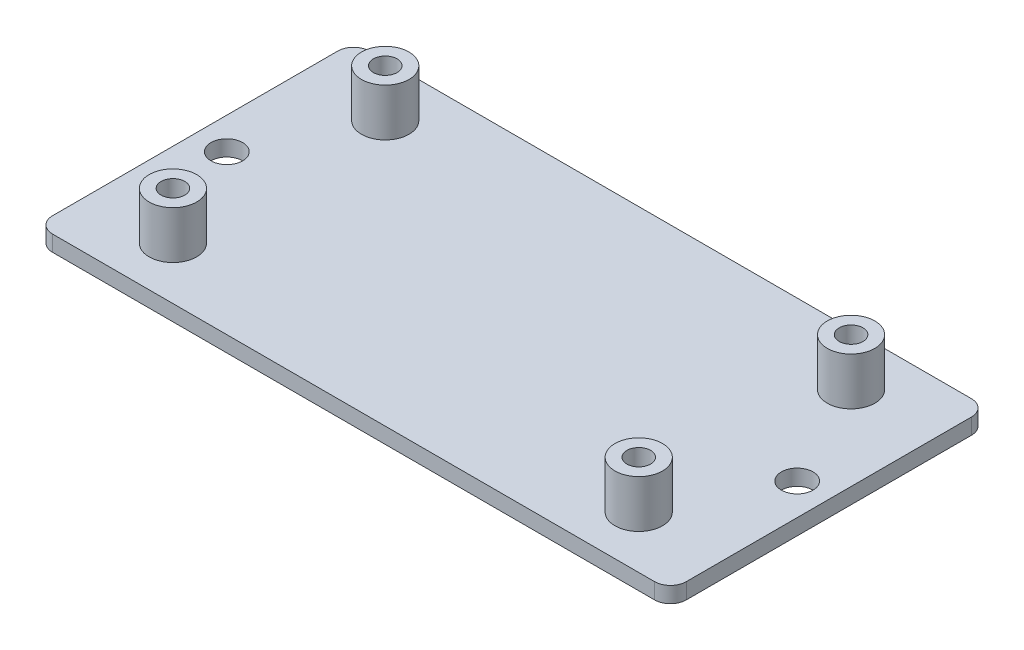
ISO-10303-21;
HEADER;
FILE_DESCRIPTION(('STEP AP214'),'2;1');
FILE_NAME('part.step','',(''),(''),'','','');
FILE_SCHEMA(('AUTOMOTIVE_DESIGN { 1 0 10303 214 1 1 1 1 }'));
ENDSEC;
DATA;
#1=APPLICATION_CONTEXT('core data for automotive mechanical design processes');
#2=APPLICATION_PROTOCOL_DEFINITION('international standard','automotive_design',2000,#1);
#3=PRODUCT_CONTEXT('',#1,'mechanical');
#4=PRODUCT('Part','Part','',(#3));
#5=PRODUCT_RELATED_PRODUCT_CATEGORY('part','',(#4));
#6=PRODUCT_DEFINITION_FORMATION('','',#4);
#7=PRODUCT_DEFINITION_CONTEXT('part definition',#1,'design');
#8=PRODUCT_DEFINITION('design','',#6,#7);
#9=PRODUCT_DEFINITION_SHAPE('','',#8);
#10=(LENGTH_UNIT() NAMED_UNIT(*) SI_UNIT(.MILLI.,.METRE.));
#11=(NAMED_UNIT(*) PLANE_ANGLE_UNIT() SI_UNIT($,.RADIAN.));
#12=(NAMED_UNIT(*) SI_UNIT($,.STERADIAN.) SOLID_ANGLE_UNIT());
#13=UNCERTAINTY_MEASURE_WITH_UNIT(LENGTH_MEASURE(1.E-05),#10,'distance_accuracy_value','');
#14=(GEOMETRIC_REPRESENTATION_CONTEXT(3) GLOBAL_UNCERTAINTY_ASSIGNED_CONTEXT((#13)) GLOBAL_UNIT_ASSIGNED_CONTEXT((#10,
#11,#12)) REPRESENTATION_CONTEXT('',''));
#15=CARTESIAN_POINT('',(0.,0.,0.));
#16=DIRECTION('',(0.,0.,1.));
#17=DIRECTION('',(1.,0.,0.));
#18=AXIS2_PLACEMENT_3D('',#15,#16,#17);
#19=CARTESIAN_POINT('',(78.,2.,2.));
#20=DIRECTION('',(0.,-1.,0.));
#21=DIRECTION('',(0.,0.,-1.));
#22=AXIS2_PLACEMENT_3D('',#19,#20,#21);
#23=CYLINDRICAL_SURFACE('',#22,2.);
#24=DIRECTION('',(0.,-1.,0.));
#25=VECTOR('',#24,1.);
#26=CARTESIAN_POINT('',(78.,2.,0.));
#27=LINE('',#26,#25);
#28=CARTESIAN_POINT('',(78.,2.,0.));
#29=VERTEX_POINT('',#28);
#30=CARTESIAN_POINT('',(78.,0.,0.));
#31=VERTEX_POINT('',#30);
#32=EDGE_CURVE('E102',#29,#31,#27,.T.);
#33=ORIENTED_EDGE('',*,*,#32,.F.);
#34=CARTESIAN_POINT('',(78.,2.,2.));
#35=DIRECTION('',(0.,1.,0.));
#36=DIRECTION('',(0.,0.,1.));
#37=AXIS2_PLACEMENT_3D('',#34,#35,#36);
#38=CIRCLE('',#37,2.);
#39=CARTESIAN_POINT('',(80.,2.,2.));
#40=VERTEX_POINT('',#39);
#41=EDGE_CURVE('E41',#40,#29,#38,.T.);
#42=ORIENTED_EDGE('',*,*,#41,.F.);
#43=DIRECTION('',(0.,-1.,0.));
#44=VECTOR('',#43,1.);
#45=CARTESIAN_POINT('',(80.,2.,2.));
#46=LINE('',#45,#44);
#47=CARTESIAN_POINT('',(80.,0.,2.));
#48=VERTEX_POINT('',#47);
#49=EDGE_CURVE('E150',#48,#40,#46,.F.);
#50=ORIENTED_EDGE('',*,*,#49,.F.);
#51=CARTESIAN_POINT('',(78.,0.,2.));
#52=DIRECTION('',(0.,1.,0.));
#53=DIRECTION('',(0.,0.,1.));
#54=AXIS2_PLACEMENT_3D('',#51,#52,#53);
#55=CIRCLE('',#54,2.);
#56=EDGE_CURVE('E11',#31,#48,#55,.F.);
#57=ORIENTED_EDGE('',*,*,#56,.F.);
#58=EDGE_LOOP('',(#33,#42,#50,#57));
#59=FACE_BOUND('',#58,.T.);
#60=ADVANCED_FACE('F34',(#59),#23,.T.);
#61=CARTESIAN_POINT('',(78.,2.,38.));
#62=DIRECTION('',(0.,1.,0.));
#63=DIRECTION('',(0.,0.,1.));
#64=AXIS2_PLACEMENT_3D('',#61,#62,#63);
#65=CYLINDRICAL_SURFACE('',#64,2.);
#66=DIRECTION('',(0.,1.,0.));
#67=VECTOR('',#66,1.);
#68=CARTESIAN_POINT('',(78.,2.,40.));
#69=LINE('',#68,#67);
#70=CARTESIAN_POINT('',(78.,0.,40.));
#71=VERTEX_POINT('',#70);
#72=CARTESIAN_POINT('',(78.,2.,40.));
#73=VERTEX_POINT('',#72);
#74=EDGE_CURVE('E139',#71,#73,#69,.T.);
#75=ORIENTED_EDGE('',*,*,#74,.F.);
#76=CARTESIAN_POINT('',(78.,0.,38.));
#77=DIRECTION('',(0.,1.,0.));
#78=DIRECTION('',(0.,0.,1.));
#79=AXIS2_PLACEMENT_3D('',#76,#77,#78);
#80=CIRCLE('',#79,2.);
#81=CARTESIAN_POINT('',(80.,0.,38.));
#82=VERTEX_POINT('',#81);
#83=EDGE_CURVE('E145',#82,#71,#80,.F.);
#84=ORIENTED_EDGE('',*,*,#83,.F.);
#85=DIRECTION('',(0.,1.,0.));
#86=VECTOR('',#85,1.);
#87=CARTESIAN_POINT('',(80.,2.,38.));
#88=LINE('',#87,#86);
#89=CARTESIAN_POINT('',(80.,2.,38.));
#90=VERTEX_POINT('',#89);
#91=EDGE_CURVE('E142',#90,#82,#88,.F.);
#92=ORIENTED_EDGE('',*,*,#91,.F.);
#93=CARTESIAN_POINT('',(78.,2.,38.));
#94=DIRECTION('',(0.,1.,0.));
#95=DIRECTION('',(0.,0.,1.));
#96=AXIS2_PLACEMENT_3D('',#93,#94,#95);
#97=CIRCLE('',#96,2.);
#98=EDGE_CURVE('E147',#73,#90,#97,.T.);
#99=ORIENTED_EDGE('',*,*,#98,.F.);
#100=EDGE_LOOP('',(#75,#84,#92,#99));
#101=FACE_BOUND('',#100,.T.);
#102=ADVANCED_FACE('F224',(#101),#65,.T.);
#103=CARTESIAN_POINT('',(2.,2.,38.));
#104=DIRECTION('',(0.,1.,0.));
#105=DIRECTION('',(0.,0.,1.));
#106=AXIS2_PLACEMENT_3D('',#103,#104,#105);
#107=CYLINDRICAL_SURFACE('',#106,2.);
#108=DIRECTION('',(0.,1.,0.));
#109=VECTOR('',#108,1.);
#110=CARTESIAN_POINT('',(0.,2.,38.));
#111=LINE('',#110,#109);
#112=CARTESIAN_POINT('',(0.,0.,38.));
#113=VERTEX_POINT('',#112);
#114=CARTESIAN_POINT('',(0.,2.,38.));
#115=VERTEX_POINT('',#114);
#116=EDGE_CURVE('E129',#113,#115,#111,.T.);
#117=ORIENTED_EDGE('',*,*,#116,.F.);
#118=CARTESIAN_POINT('',(2.,0.,38.));
#119=DIRECTION('',(0.,1.,0.));
#120=DIRECTION('',(0.,0.,1.));
#121=AXIS2_PLACEMENT_3D('',#118,#119,#120);
#122=CIRCLE('',#121,2.);
#123=CARTESIAN_POINT('',(2.,0.,40.));
#124=VERTEX_POINT('',#123);
#125=EDGE_CURVE('E135',#124,#113,#122,.F.);
#126=ORIENTED_EDGE('',*,*,#125,.F.);
#127=DIRECTION('',(0.,1.,0.));
#128=VECTOR('',#127,1.);
#129=CARTESIAN_POINT('',(2.,2.,40.));
#130=LINE('',#129,#128);
#131=CARTESIAN_POINT('',(2.,2.,40.));
#132=VERTEX_POINT('',#131);
#133=EDGE_CURVE('E132',#132,#124,#130,.F.);
#134=ORIENTED_EDGE('',*,*,#133,.F.);
#135=CARTESIAN_POINT('',(2.,2.,38.));
#136=DIRECTION('',(0.,1.,0.));
#137=DIRECTION('',(0.,0.,1.));
#138=AXIS2_PLACEMENT_3D('',#135,#136,#137);
#139=CIRCLE('',#138,2.);
#140=EDGE_CURVE('E137',#115,#132,#139,.T.);
#141=ORIENTED_EDGE('',*,*,#140,.F.);
#142=EDGE_LOOP('',(#117,#126,#134,#141));
#143=FACE_BOUND('',#142,.T.);
#144=ADVANCED_FACE('F218',(#143),#107,.T.);
#145=CARTESIAN_POINT('',(2.,2.,2.));
#146=DIRECTION('',(0.,1.,0.));
#147=DIRECTION('',(0.,0.,1.));
#148=AXIS2_PLACEMENT_3D('',#145,#146,#147);
#149=CYLINDRICAL_SURFACE('',#148,2.);
#150=DIRECTION('',(0.,1.,0.));
#151=VECTOR('',#150,1.);
#152=CARTESIAN_POINT('',(2.,2.,0.));
#153=LINE('',#152,#151);
#154=CARTESIAN_POINT('',(2.,0.,0.));
#155=VERTEX_POINT('',#154);
#156=CARTESIAN_POINT('',(2.,2.,0.));
#157=VERTEX_POINT('',#156);
#158=EDGE_CURVE('E101',#155,#157,#153,.T.);
#159=ORIENTED_EDGE('',*,*,#158,.F.);
#160=CARTESIAN_POINT('',(2.,0.,2.));
#161=DIRECTION('',(0.,1.,0.));
#162=DIRECTION('',(0.,0.,1.));
#163=AXIS2_PLACEMENT_3D('',#160,#161,#162);
#164=CIRCLE('',#163,2.);
#165=CARTESIAN_POINT('',(0.,0.,2.));
#166=VERTEX_POINT('',#165);
#167=EDGE_CURVE('E107',#166,#155,#164,.F.);
#168=ORIENTED_EDGE('',*,*,#167,.F.);
#169=DIRECTION('',(0.,1.,0.));
#170=VECTOR('',#169,1.);
#171=CARTESIAN_POINT('',(0.,2.,2.));
#172=LINE('',#171,#170);
#173=CARTESIAN_POINT('',(0.,2.,2.));
#174=VERTEX_POINT('',#173);
#175=EDGE_CURVE('E115',#174,#166,#172,.F.);
#176=ORIENTED_EDGE('',*,*,#175,.F.);
#177=CARTESIAN_POINT('',(2.,2.,2.));
#178=DIRECTION('',(0.,1.,0.));
#179=DIRECTION('',(0.,0.,1.));
#180=AXIS2_PLACEMENT_3D('',#177,#178,#179);
#181=CIRCLE('',#180,2.);
#182=EDGE_CURVE('E114',#157,#174,#181,.T.);
#183=ORIENTED_EDGE('',*,*,#182,.F.);
#184=EDGE_LOOP('',(#159,#168,#176,#183));
#185=FACE_BOUND('',#184,.T.);
#186=ADVANCED_FACE('F118',(#185),#149,.T.);
#187=CARTESIAN_POINT('',(0.,2.,0.));
#188=DIRECTION('',(1.,0.,0.));
#189=DIRECTION('',(0.,0.,-1.));
#190=AXIS2_PLACEMENT_3D('',#187,#188,#189);
#191=PLANE('',#190);
#192=DIRECTION('',(0.,0.,1.));
#193=VECTOR('',#192,1.);
#194=CARTESIAN_POINT('',(0.,0.,0.));
#195=LINE('',#194,#193);
#196=EDGE_CURVE('E110',#166,#113,#195,.T.);
#197=ORIENTED_EDGE('',*,*,#196,.T.);
#198=ORIENTED_EDGE('',*,*,#116,.T.);
#199=DIRECTION('',(0.,0.,1.));
#200=VECTOR('',#199,1.);
#201=CARTESIAN_POINT('',(0.,2.,0.));
#202=LINE('',#201,#200);
#203=EDGE_CURVE('E103',#174,#115,#202,.T.);
#204=ORIENTED_EDGE('',*,*,#203,.F.);
#205=ORIENTED_EDGE('',*,*,#175,.T.);
#206=EDGE_LOOP('',(#197,#198,#204,#205));
#207=FACE_BOUND('',#206,.T.);
#208=ADVANCED_FACE('F212',(#207),#191,.F.);
#209=CARTESIAN_POINT('',(0.,2.,40.));
#210=DIRECTION('',(0.,0.,-1.));
#211=DIRECTION('',(-1.,0.,0.));
#212=AXIS2_PLACEMENT_3D('',#209,#210,#211);
#213=PLANE('',#212);
#214=DIRECTION('',(1.,0.,0.));
#215=VECTOR('',#214,1.);
#216=CARTESIAN_POINT('',(0.,0.,40.));
#217=LINE('',#216,#215);
#218=EDGE_CURVE('E159',#124,#71,#217,.T.);
#219=ORIENTED_EDGE('',*,*,#218,.T.);
#220=ORIENTED_EDGE('',*,*,#74,.T.);
#221=DIRECTION('',(1.,0.,0.));
#222=VECTOR('',#221,1.);
#223=CARTESIAN_POINT('',(0.,2.,40.));
#224=LINE('',#223,#222);
#225=EDGE_CURVE('E208',#132,#73,#224,.T.);
#226=ORIENTED_EDGE('',*,*,#225,.F.);
#227=ORIENTED_EDGE('',*,*,#133,.T.);
#228=EDGE_LOOP('',(#219,#220,#226,#227));
#229=FACE_BOUND('',#228,.T.);
#230=ADVANCED_FACE('F221',(#229),#213,.F.);
#231=CARTESIAN_POINT('',(80.,2.,0.));
#232=DIRECTION('',(-1.,0.,0.));
#233=DIRECTION('',(0.,0.,1.));
#234=AXIS2_PLACEMENT_3D('',#231,#232,#233);
#235=PLANE('',#234);
#236=DIRECTION('',(0.,0.,-1.));
#237=VECTOR('',#236,1.);
#238=CARTESIAN_POINT('',(80.,0.,0.));
#239=LINE('',#238,#237);
#240=EDGE_CURVE('E104',#82,#48,#239,.T.);
#241=ORIENTED_EDGE('',*,*,#240,.T.);
#242=ORIENTED_EDGE('',*,*,#49,.T.);
#243=DIRECTION('',(0.,0.,-1.));
#244=VECTOR('',#243,1.);
#245=CARTESIAN_POINT('',(80.,2.,0.));
#246=LINE('',#245,#244);
#247=EDGE_CURVE('E122',#90,#40,#246,.T.);
#248=ORIENTED_EDGE('',*,*,#247,.F.);
#249=ORIENTED_EDGE('',*,*,#91,.T.);
#250=EDGE_LOOP('',(#241,#242,#248,#249));
#251=FACE_BOUND('',#250,.T.);
#252=ADVANCED_FACE('F157',(#251),#235,.F.);
#253=CARTESIAN_POINT('',(0.,2.,0.));
#254=DIRECTION('',(0.,0.,1.));
#255=DIRECTION('',(1.,0.,0.));
#256=AXIS2_PLACEMENT_3D('',#253,#254,#255);
#257=PLANE('',#256);
#258=DIRECTION('',(-1.,0.,0.));
#259=VECTOR('',#258,1.);
#260=CARTESIAN_POINT('',(0.,2.,0.));
#261=LINE('',#260,#259);
#262=EDGE_CURVE('E119',#29,#157,#261,.T.);
#263=ORIENTED_EDGE('',*,*,#262,.F.);
#264=ORIENTED_EDGE('',*,*,#32,.T.);
#265=DIRECTION('',(-1.,0.,0.));
#266=VECTOR('',#265,1.);
#267=CARTESIAN_POINT('',(0.,0.,0.));
#268=LINE('',#267,#266);
#269=EDGE_CURVE('E96',#31,#155,#268,.T.);
#270=ORIENTED_EDGE('',*,*,#269,.T.);
#271=ORIENTED_EDGE('',*,*,#158,.T.);
#272=EDGE_LOOP('',(#263,#264,#270,#271));
#273=FACE_BOUND('',#272,.T.);
#274=ADVANCED_FACE('F99',(#273),#257,.F.);
#275=CARTESIAN_POINT('',(0.,2.,0.));
#276=DIRECTION('',(0.,1.,0.));
#277=DIRECTION('',(0.,0.,1.));
#278=AXIS2_PLACEMENT_3D('',#275,#276,#277);
#279=PLANE('',#278);
#280=CARTESIAN_POINT('',(4.,2.,20.));
#281=DIRECTION('',(0.,1.,0.));
#282=DIRECTION('',(0.,0.,1.));
#283=AXIS2_PLACEMENT_3D('',#280,#281,#282);
#284=CIRCLE('',#283,2.);
#285=CARTESIAN_POINT('',(4.,2.,22.));
#286=VERTEX_POINT('',#285);
#287=EDGE_CURVE('E306',#286,#286,#284,.T.);
#288=ORIENTED_EDGE('',*,*,#287,.F.);
#289=EDGE_LOOP('',(#288));
#290=FACE_BOUND('',#289,.T.);
#291=CARTESIAN_POINT('',(76.,2.,20.));
#292=DIRECTION('',(0.,1.,0.));
#293=DIRECTION('',(0.,0.,1.));
#294=AXIS2_PLACEMENT_3D('',#291,#292,#293);
#295=CIRCLE('',#294,2.);
#296=CARTESIAN_POINT('',(76.,2.,22.));
#297=VERTEX_POINT('',#296);
#298=EDGE_CURVE('E310',#297,#297,#295,.T.);
#299=ORIENTED_EDGE('',*,*,#298,.F.);
#300=EDGE_LOOP('',(#299));
#301=FACE_BOUND('',#300,.T.);
#302=CARTESIAN_POINT('',(69.4,2.,33.4));
#303=DIRECTION('',(0.,1.,0.));
#304=DIRECTION('',(0.,0.,1.));
#305=AXIS2_PLACEMENT_3D('',#302,#303,#304);
#306=CIRCLE('',#305,3.00000000000001);
#307=CARTESIAN_POINT('',(69.4,2.,36.4));
#308=VERTEX_POINT('',#307);
#309=EDGE_CURVE('E176',#308,#308,#306,.T.);
#310=ORIENTED_EDGE('',*,*,#309,.F.);
#311=EDGE_LOOP('',(#310));
#312=FACE_BOUND('',#311,.T.);
#313=CARTESIAN_POINT('',(69.4,2.,6.6));
#314=DIRECTION('',(0.,1.,0.));
#315=DIRECTION('',(0.,0.,1.));
#316=AXIS2_PLACEMENT_3D('',#313,#314,#315);
#317=CIRCLE('',#316,3.00000000000001);
#318=CARTESIAN_POINT('',(69.4,2.,9.60000000000001));
#319=VERTEX_POINT('',#318);
#320=EDGE_CURVE('E185',#319,#319,#317,.T.);
#321=ORIENTED_EDGE('',*,*,#320,.F.);
#322=EDGE_LOOP('',(#321));
#323=FACE_BOUND('',#322,.T.);
#324=CARTESIAN_POINT('',(10.6,2.,33.4));
#325=DIRECTION('',(0.,1.,0.));
#326=DIRECTION('',(0.,0.,1.));
#327=AXIS2_PLACEMENT_3D('',#324,#325,#326);
#328=CIRCLE('',#327,3.);
#329=CARTESIAN_POINT('',(10.6,2.,36.4));
#330=VERTEX_POINT('',#329);
#331=EDGE_CURVE('E192',#330,#330,#328,.T.);
#332=ORIENTED_EDGE('',*,*,#331,.F.);
#333=EDGE_LOOP('',(#332));
#334=FACE_BOUND('',#333,.T.);
#335=CARTESIAN_POINT('',(10.6,2.,6.6));
#336=DIRECTION('',(0.,1.,0.));
#337=DIRECTION('',(0.,0.,1.));
#338=AXIS2_PLACEMENT_3D('',#335,#336,#337);
#339=CIRCLE('',#338,3.);
#340=CARTESIAN_POINT('',(10.6,2.,9.6));
#341=VERTEX_POINT('',#340);
#342=EDGE_CURVE('E198',#341,#341,#339,.T.);
#343=ORIENTED_EDGE('',*,*,#342,.F.);
#344=EDGE_LOOP('',(#343));
#345=FACE_BOUND('',#344,.T.);
#346=ORIENTED_EDGE('',*,*,#247,.T.);
#347=ORIENTED_EDGE('',*,*,#41,.T.);
#348=ORIENTED_EDGE('',*,*,#262,.T.);
#349=ORIENTED_EDGE('',*,*,#182,.T.);
#350=ORIENTED_EDGE('',*,*,#203,.T.);
#351=ORIENTED_EDGE('',*,*,#140,.T.);
#352=ORIENTED_EDGE('',*,*,#225,.T.);
#353=ORIENTED_EDGE('',*,*,#98,.T.);
#354=EDGE_LOOP('',(#346,#347,#348,#349,#350,#351,#352,#353));
#355=FACE_BOUND('',#354,.T.);
#356=ADVANCED_FACE('F153',(#290,#301,#312,#323,#334,#345,#355),#279,.T.);
#357=CARTESIAN_POINT('',(0.,0.,0.));
#358=DIRECTION('',(0.,1.,0.));
#359=DIRECTION('',(0.,0.,1.));
#360=AXIS2_PLACEMENT_3D('',#357,#358,#359);
#361=PLANE('',#360);
#362=CARTESIAN_POINT('',(4.,0.,20.));
#363=DIRECTION('',(0.,1.,0.));
#364=DIRECTION('',(0.,0.,1.));
#365=AXIS2_PLACEMENT_3D('',#362,#363,#364);
#366=CIRCLE('',#365,2.);
#367=CARTESIAN_POINT('',(4.,0.,22.));
#368=VERTEX_POINT('',#367);
#369=EDGE_CURVE('E309',#368,#368,#366,.T.);
#370=ORIENTED_EDGE('',*,*,#369,.T.);
#371=EDGE_LOOP('',(#370));
#372=FACE_BOUND('',#371,.T.);
#373=CARTESIAN_POINT('',(76.,0.,20.));
#374=DIRECTION('',(0.,1.,0.));
#375=DIRECTION('',(0.,0.,1.));
#376=AXIS2_PLACEMENT_3D('',#373,#374,#375);
#377=CIRCLE('',#376,2.);
#378=CARTESIAN_POINT('',(76.,0.,22.));
#379=VERTEX_POINT('',#378);
#380=EDGE_CURVE('E311',#379,#379,#377,.T.);
#381=ORIENTED_EDGE('',*,*,#380,.T.);
#382=EDGE_LOOP('',(#381));
#383=FACE_BOUND('',#382,.T.);
#384=CARTESIAN_POINT('',(10.6,0.,33.4));
#385=DIRECTION('',(0.,1.,0.));
#386=DIRECTION('',(0.,0.,1.));
#387=AXIS2_PLACEMENT_3D('',#384,#385,#386);
#388=CIRCLE('',#387,1.5);
#389=CARTESIAN_POINT('',(10.6,0.,34.9));
#390=VERTEX_POINT('',#389);
#391=EDGE_CURVE('E323',#390,#390,#388,.T.);
#392=ORIENTED_EDGE('',*,*,#391,.T.);
#393=EDGE_LOOP('',(#392));
#394=FACE_BOUND('',#393,.T.);
#395=CARTESIAN_POINT('',(69.4,0.,6.6));
#396=DIRECTION('',(0.,1.,0.));
#397=DIRECTION('',(0.,0.,1.));
#398=AXIS2_PLACEMENT_3D('',#395,#396,#397);
#399=CIRCLE('',#398,1.5);
#400=CARTESIAN_POINT('',(69.4,0.,8.1));
#401=VERTEX_POINT('',#400);
#402=EDGE_CURVE('E322',#401,#401,#399,.T.);
#403=ORIENTED_EDGE('',*,*,#402,.T.);
#404=EDGE_LOOP('',(#403));
#405=FACE_BOUND('',#404,.T.);
#406=CARTESIAN_POINT('',(69.4,0.,33.4));
#407=DIRECTION('',(0.,1.,0.));
#408=DIRECTION('',(0.,0.,1.));
#409=AXIS2_PLACEMENT_3D('',#406,#407,#408);
#410=CIRCLE('',#409,1.5);
#411=CARTESIAN_POINT('',(69.4,0.,34.9));
#412=VERTEX_POINT('',#411);
#413=EDGE_CURVE('E319',#412,#412,#410,.T.);
#414=ORIENTED_EDGE('',*,*,#413,.T.);
#415=EDGE_LOOP('',(#414));
#416=FACE_BOUND('',#415,.T.);
#417=CARTESIAN_POINT('',(10.6,0.,6.6));
#418=DIRECTION('',(0.,1.,0.));
#419=DIRECTION('',(0.,0.,1.));
#420=AXIS2_PLACEMENT_3D('',#417,#418,#419);
#421=CIRCLE('',#420,1.5);
#422=CARTESIAN_POINT('',(10.6,0.,8.1));
#423=VERTEX_POINT('',#422);
#424=EDGE_CURVE('E169',#423,#423,#421,.T.);
#425=ORIENTED_EDGE('',*,*,#424,.T.);
#426=EDGE_LOOP('',(#425));
#427=FACE_BOUND('',#426,.T.);
#428=ORIENTED_EDGE('',*,*,#269,.F.);
#429=ORIENTED_EDGE('',*,*,#56,.T.);
#430=ORIENTED_EDGE('',*,*,#240,.F.);
#431=ORIENTED_EDGE('',*,*,#83,.T.);
#432=ORIENTED_EDGE('',*,*,#218,.F.);
#433=ORIENTED_EDGE('',*,*,#125,.T.);
#434=ORIENTED_EDGE('',*,*,#196,.F.);
#435=ORIENTED_EDGE('',*,*,#167,.T.);
#436=EDGE_LOOP('',(#428,#429,#430,#431,#432,#433,#434,#435));
#437=FACE_BOUND('',#436,.T.);
#438=ADVANCED_FACE('F108',(#372,#383,#394,#405,#416,#427,#437),#361,.F.);
#439=CARTESIAN_POINT('',(10.6,8.,6.6));
#440=DIRECTION('',(0.,-1.,0.));
#441=DIRECTION('',(0.,0.,-1.));
#442=AXIS2_PLACEMENT_3D('',#439,#440,#441);
#443=CYLINDRICAL_SURFACE('',#442,3.);
#444=CARTESIAN_POINT('',(10.6,8.,6.6));
#445=DIRECTION('',(0.,1.,0.));
#446=DIRECTION('',(0.,0.,1.));
#447=AXIS2_PLACEMENT_3D('',#444,#445,#446);
#448=CIRCLE('',#447,3.);
#449=CARTESIAN_POINT('',(10.6,8.,9.6));
#450=VERTEX_POINT('',#449);
#451=EDGE_CURVE('E201',#450,#450,#448,.T.);
#452=ORIENTED_EDGE('',*,*,#451,.F.);
#453=EDGE_LOOP('',(#452));
#454=FACE_BOUND('',#453,.T.);
#455=ORIENTED_EDGE('',*,*,#342,.T.);
#456=EDGE_LOOP('',(#455));
#457=FACE_BOUND('',#456,.T.);
#458=ADVANCED_FACE('F244',(#454,#457),#443,.T.);
#459=CARTESIAN_POINT('',(10.6,8.,6.6));
#460=DIRECTION('',(0.,1.,0.));
#461=DIRECTION('',(0.,0.,1.));
#462=AXIS2_PLACEMENT_3D('',#459,#460,#461);
#463=PLANE('',#462);
#464=CARTESIAN_POINT('',(10.6,8.,6.6));
#465=DIRECTION('',(0.,1.,0.));
#466=DIRECTION('',(0.,0.,1.));
#467=AXIS2_PLACEMENT_3D('',#464,#465,#466);
#468=CIRCLE('',#467,1.5);
#469=CARTESIAN_POINT('',(10.6,8.,8.1));
#470=VERTEX_POINT('',#469);
#471=EDGE_CURVE('E125',#470,#470,#468,.T.);
#472=ORIENTED_EDGE('',*,*,#471,.F.);
#473=EDGE_LOOP('',(#472));
#474=FACE_BOUND('',#473,.T.);
#475=ORIENTED_EDGE('',*,*,#451,.T.);
#476=EDGE_LOOP('',(#475));
#477=FACE_BOUND('',#476,.T.);
#478=ADVANCED_FACE('F251',(#474,#477),#463,.T.);
#479=CARTESIAN_POINT('',(10.6,8.,33.4));
#480=DIRECTION('',(0.,-1.,0.));
#481=DIRECTION('',(0.,0.,-1.));
#482=AXIS2_PLACEMENT_3D('',#479,#480,#481);
#483=CYLINDRICAL_SURFACE('',#482,3.);
#484=CARTESIAN_POINT('',(10.6,8.,33.4));
#485=DIRECTION('',(0.,1.,0.));
#486=DIRECTION('',(0.,0.,1.));
#487=AXIS2_PLACEMENT_3D('',#484,#485,#486);
#488=CIRCLE('',#487,3.);
#489=CARTESIAN_POINT('',(10.6,8.,36.4));
#490=VERTEX_POINT('',#489);
#491=EDGE_CURVE('E195',#490,#490,#488,.T.);
#492=ORIENTED_EDGE('',*,*,#491,.F.);
#493=EDGE_LOOP('',(#492));
#494=FACE_BOUND('',#493,.T.);
#495=ORIENTED_EDGE('',*,*,#331,.T.);
#496=EDGE_LOOP('',(#495));
#497=FACE_BOUND('',#496,.T.);
#498=ADVANCED_FACE('F255',(#494,#497),#483,.T.);
#499=CARTESIAN_POINT('',(10.6,8.,33.4));
#500=DIRECTION('',(0.,1.,0.));
#501=DIRECTION('',(0.,0.,1.));
#502=AXIS2_PLACEMENT_3D('',#499,#500,#501);
#503=PLANE('',#502);
#504=CARTESIAN_POINT('',(10.6,8.,33.4));
#505=DIRECTION('',(0.,1.,0.));
#506=DIRECTION('',(0.,0.,1.));
#507=AXIS2_PLACEMENT_3D('',#504,#505,#506);
#508=CIRCLE('',#507,1.5);
#509=CARTESIAN_POINT('',(10.6,8.,34.9));
#510=VERTEX_POINT('',#509);
#511=EDGE_CURVE('E171',#510,#510,#508,.T.);
#512=ORIENTED_EDGE('',*,*,#511,.F.);
#513=EDGE_LOOP('',(#512));
#514=FACE_BOUND('',#513,.T.);
#515=ORIENTED_EDGE('',*,*,#491,.T.);
#516=EDGE_LOOP('',(#515));
#517=FACE_BOUND('',#516,.T.);
#518=ADVANCED_FACE('F259',(#514,#517),#503,.T.);
#519=CARTESIAN_POINT('',(69.4,8.,6.6));
#520=DIRECTION('',(0.,-1.,0.));
#521=DIRECTION('',(0.,0.,-1.));
#522=AXIS2_PLACEMENT_3D('',#519,#520,#521);
#523=CYLINDRICAL_SURFACE('',#522,3.00000000000001);
#524=CARTESIAN_POINT('',(69.4,8.,6.6));
#525=DIRECTION('',(0.,1.,0.));
#526=DIRECTION('',(0.,0.,1.));
#527=AXIS2_PLACEMENT_3D('',#524,#525,#526);
#528=CIRCLE('',#527,3.00000000000001);
#529=CARTESIAN_POINT('',(69.4,8.,9.60000000000001));
#530=VERTEX_POINT('',#529);
#531=EDGE_CURVE('E189',#530,#530,#528,.T.);
#532=ORIENTED_EDGE('',*,*,#531,.F.);
#533=EDGE_LOOP('',(#532));
#534=FACE_BOUND('',#533,.T.);
#535=ORIENTED_EDGE('',*,*,#320,.T.);
#536=EDGE_LOOP('',(#535));
#537=FACE_BOUND('',#536,.T.);
#538=ADVANCED_FACE('F263',(#534,#537),#523,.T.);
#539=CARTESIAN_POINT('',(69.4,8.,6.6));
#540=DIRECTION('',(0.,1.,0.));
#541=DIRECTION('',(0.,0.,1.));
#542=AXIS2_PLACEMENT_3D('',#539,#540,#541);
#543=PLANE('',#542);
#544=CARTESIAN_POINT('',(69.4,8.,6.6));
#545=DIRECTION('',(0.,1.,0.));
#546=DIRECTION('',(0.,0.,1.));
#547=AXIS2_PLACEMENT_3D('',#544,#545,#546);
#548=CIRCLE('',#547,1.5);
#549=CARTESIAN_POINT('',(69.4,8.,8.1));
#550=VERTEX_POINT('',#549);
#551=EDGE_CURVE('E168',#550,#550,#548,.T.);
#552=ORIENTED_EDGE('',*,*,#551,.F.);
#553=EDGE_LOOP('',(#552));
#554=FACE_BOUND('',#553,.T.);
#555=ORIENTED_EDGE('',*,*,#531,.T.);
#556=EDGE_LOOP('',(#555));
#557=FACE_BOUND('',#556,.T.);
#558=ADVANCED_FACE('F267',(#554,#557),#543,.T.);
#559=CARTESIAN_POINT('',(69.4,8.,33.4));
#560=DIRECTION('',(0.,-1.,0.));
#561=DIRECTION('',(0.,0.,-1.));
#562=AXIS2_PLACEMENT_3D('',#559,#560,#561);
#563=CYLINDRICAL_SURFACE('',#562,3.00000000000001);
#564=CARTESIAN_POINT('',(69.4,8.,33.4));
#565=DIRECTION('',(0.,1.,0.));
#566=DIRECTION('',(0.,0.,1.));
#567=AXIS2_PLACEMENT_3D('',#564,#565,#566);
#568=CIRCLE('',#567,3.00000000000001);
#569=CARTESIAN_POINT('',(69.4,8.,36.4));
#570=VERTEX_POINT('',#569);
#571=EDGE_CURVE('E180',#570,#570,#568,.T.);
#572=ORIENTED_EDGE('',*,*,#571,.F.);
#573=EDGE_LOOP('',(#572));
#574=FACE_BOUND('',#573,.T.);
#575=ORIENTED_EDGE('',*,*,#309,.T.);
#576=EDGE_LOOP('',(#575));
#577=FACE_BOUND('',#576,.T.);
#578=ADVANCED_FACE('F271',(#574,#577),#563,.T.);
#579=CARTESIAN_POINT('',(69.4,8.,33.4));
#580=DIRECTION('',(0.,1.,0.));
#581=DIRECTION('',(0.,0.,1.));
#582=AXIS2_PLACEMENT_3D('',#579,#580,#581);
#583=PLANE('',#582);
#584=CARTESIAN_POINT('',(69.4,8.,33.4));
#585=DIRECTION('',(0.,1.,0.));
#586=DIRECTION('',(0.,0.,1.));
#587=AXIS2_PLACEMENT_3D('',#584,#585,#586);
#588=CIRCLE('',#587,1.5);
#589=CARTESIAN_POINT('',(69.4,8.,34.9));
#590=VERTEX_POINT('',#589);
#591=EDGE_CURVE('E165',#590,#590,#588,.T.);
#592=ORIENTED_EDGE('',*,*,#591,.F.);
#593=EDGE_LOOP('',(#592));
#594=FACE_BOUND('',#593,.T.);
#595=ORIENTED_EDGE('',*,*,#571,.T.);
#596=EDGE_LOOP('',(#595));
#597=FACE_BOUND('',#596,.T.);
#598=ADVANCED_FACE('F275',(#594,#597),#583,.T.);
#599=CARTESIAN_POINT('',(69.4,0.,33.4));
#600=DIRECTION('',(0.,1.,0.));
#601=DIRECTION('',(0.,0.,1.));
#602=AXIS2_PLACEMENT_3D('',#599,#600,#601);
#603=CYLINDRICAL_SURFACE('',#602,1.5);
#604=ORIENTED_EDGE('',*,*,#591,.T.);
#605=EDGE_LOOP('',(#604));
#606=FACE_BOUND('',#605,.T.);
#607=ORIENTED_EDGE('',*,*,#413,.F.);
#608=EDGE_LOOP('',(#607));
#609=FACE_BOUND('',#608,.T.);
#610=ADVANCED_FACE('F279',(#606,#609),#603,.F.);
#611=CARTESIAN_POINT('',(69.4,0.,6.6));
#612=DIRECTION('',(0.,1.,0.));
#613=DIRECTION('',(0.,0.,1.));
#614=AXIS2_PLACEMENT_3D('',#611,#612,#613);
#615=CYLINDRICAL_SURFACE('',#614,1.5);
#616=ORIENTED_EDGE('',*,*,#551,.T.);
#617=EDGE_LOOP('',(#616));
#618=FACE_BOUND('',#617,.T.);
#619=ORIENTED_EDGE('',*,*,#402,.F.);
#620=EDGE_LOOP('',(#619));
#621=FACE_BOUND('',#620,.T.);
#622=ADVANCED_FACE('F286',(#618,#621),#615,.F.);
#623=CARTESIAN_POINT('',(10.6,0.,33.4));
#624=DIRECTION('',(0.,1.,0.));
#625=DIRECTION('',(0.,0.,1.));
#626=AXIS2_PLACEMENT_3D('',#623,#624,#625);
#627=CYLINDRICAL_SURFACE('',#626,1.5);
#628=ORIENTED_EDGE('',*,*,#511,.T.);
#629=EDGE_LOOP('',(#628));
#630=FACE_BOUND('',#629,.T.);
#631=ORIENTED_EDGE('',*,*,#391,.F.);
#632=EDGE_LOOP('',(#631));
#633=FACE_BOUND('',#632,.T.);
#634=ADVANCED_FACE('F285',(#630,#633),#627,.F.);
#635=CARTESIAN_POINT('',(10.6,0.,6.6));
#636=DIRECTION('',(0.,1.,0.));
#637=DIRECTION('',(0.,0.,1.));
#638=AXIS2_PLACEMENT_3D('',#635,#636,#637);
#639=CYLINDRICAL_SURFACE('',#638,1.5);
#640=ORIENTED_EDGE('',*,*,#471,.T.);
#641=EDGE_LOOP('',(#640));
#642=FACE_BOUND('',#641,.T.);
#643=ORIENTED_EDGE('',*,*,#424,.F.);
#644=EDGE_LOOP('',(#643));
#645=FACE_BOUND('',#644,.T.);
#646=ADVANCED_FACE('F281',(#642,#645),#639,.F.);
#647=CARTESIAN_POINT('',(76.,0.,20.));
#648=DIRECTION('',(0.,1.,0.));
#649=DIRECTION('',(0.,0.,1.));
#650=AXIS2_PLACEMENT_3D('',#647,#648,#649);
#651=CYLINDRICAL_SURFACE('',#650,2.);
#652=ORIENTED_EDGE('',*,*,#298,.T.);
#653=EDGE_LOOP('',(#652));
#654=FACE_BOUND('',#653,.T.);
#655=ORIENTED_EDGE('',*,*,#380,.F.);
#656=EDGE_LOOP('',(#655));
#657=FACE_BOUND('',#656,.T.);
#658=ADVANCED_FACE('F284',(#654,#657),#651,.F.);
#659=CARTESIAN_POINT('',(4.,0.,20.));
#660=DIRECTION('',(0.,1.,0.));
#661=DIRECTION('',(0.,0.,1.));
#662=AXIS2_PLACEMENT_3D('',#659,#660,#661);
#663=CYLINDRICAL_SURFACE('',#662,2.);
#664=ORIENTED_EDGE('',*,*,#287,.T.);
#665=EDGE_LOOP('',(#664));
#666=FACE_BOUND('',#665,.T.);
#667=ORIENTED_EDGE('',*,*,#369,.F.);
#668=EDGE_LOOP('',(#667));
#669=FACE_BOUND('',#668,.T.);
#670=ADVANCED_FACE('F297',(#666,#669),#663,.F.);
#671=CLOSED_SHELL('',(#60,#102,#144,#186,#208,#230,#252,#274,#356,#438,#458,#478,#498,#518,#538,
#558,#578,#598,#610,#622,#634,#646,#658,#670));
#672=MANIFOLD_SOLID_BREP('B2',#671);
#673=ADVANCED_BREP_SHAPE_REPRESENTATION('',(#18,#672),#14);
#674=SHAPE_DEFINITION_REPRESENTATION(#9,#673);
ENDSEC;
END-ISO-10303-21;
